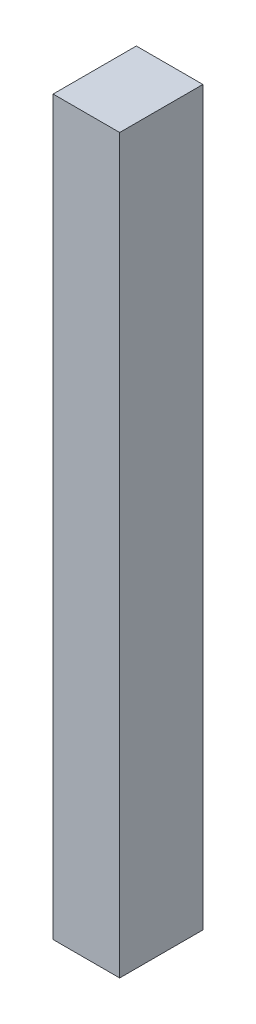
ISO-10303-21;
HEADER;
FILE_DESCRIPTION(('STEP AP214'),'2;1');
FILE_NAME('part.step','',(''),(''),'','','');
FILE_SCHEMA(('AUTOMOTIVE_DESIGN { 1 0 10303 214 1 1 1 1 }'));
ENDSEC;
DATA;
#1=APPLICATION_CONTEXT('core data for automotive mechanical design processes');
#2=APPLICATION_PROTOCOL_DEFINITION('international standard','automotive_design',2000,#1);
#3=PRODUCT_CONTEXT('',#1,'mechanical');
#4=PRODUCT('Part','Part','',(#3));
#5=PRODUCT_RELATED_PRODUCT_CATEGORY('part','',(#4));
#6=PRODUCT_DEFINITION_FORMATION('','',#4);
#7=PRODUCT_DEFINITION_CONTEXT('part definition',#1,'design');
#8=PRODUCT_DEFINITION('design','',#6,#7);
#9=PRODUCT_DEFINITION_SHAPE('','',#8);
#10=(LENGTH_UNIT() NAMED_UNIT(*) SI_UNIT(.MILLI.,.METRE.));
#11=(NAMED_UNIT(*) PLANE_ANGLE_UNIT() SI_UNIT($,.RADIAN.));
#12=(NAMED_UNIT(*) SI_UNIT($,.STERADIAN.) SOLID_ANGLE_UNIT());
#13=UNCERTAINTY_MEASURE_WITH_UNIT(LENGTH_MEASURE(1.E-05),#10,'distance_accuracy_value','');
#14=(GEOMETRIC_REPRESENTATION_CONTEXT(3) GLOBAL_UNCERTAINTY_ASSIGNED_CONTEXT((#13)) GLOBAL_UNIT_ASSIGNED_CONTEXT((#10,
#11,#12)) REPRESENTATION_CONTEXT('',''));
#15=CARTESIAN_POINT('',(0.,0.,0.));
#16=DIRECTION('',(0.,0.,1.));
#17=DIRECTION('',(1.,0.,0.));
#18=AXIS2_PLACEMENT_3D('',#15,#16,#17);
#19=CARTESIAN_POINT('',(39.9999999999998,440.,100.));
#20=DIRECTION('',(-1.,0.,0.));
#21=DIRECTION('',(0.,0.,1.));
#22=AXIS2_PLACEMENT_3D('',#19,#20,#21);
#23=PLANE('',#22);
#24=DIRECTION('',(0.,1.,0.));
#25=VECTOR('',#24,1.);
#26=CARTESIAN_POINT('',(39.9999999999998,440.,0.));
#27=LINE('',#26,#25);
#28=CARTESIAN_POINT('',(39.9999999999998,-440.,0.));
#29=VERTEX_POINT('',#28);
#30=CARTESIAN_POINT('',(39.9999999999998,440.,0.));
#31=VERTEX_POINT('',#30);
#32=EDGE_CURVE('E96',#29,#31,#27,.T.);
#33=ORIENTED_EDGE('',*,*,#32,.T.);
#34=DIRECTION('',(0.,0.,-1.));
#35=VECTOR('',#34,1.);
#36=CARTESIAN_POINT('',(39.9999999999998,440.,100.));
#37=LINE('',#36,#35);
#38=CARTESIAN_POINT('',(39.9999999999998,440.,100.));
#39=VERTEX_POINT('',#38);
#40=EDGE_CURVE('E11',#39,#31,#37,.T.);
#41=ORIENTED_EDGE('',*,*,#40,.F.);
#42=DIRECTION('',(0.,1.,0.));
#43=VECTOR('',#42,1.);
#44=CARTESIAN_POINT('',(39.9999999999998,440.,100.));
#45=LINE('',#44,#43);
#46=CARTESIAN_POINT('',(39.9999999999998,-440.,100.));
#47=VERTEX_POINT('',#46);
#48=EDGE_CURVE('E84',#47,#39,#45,.T.);
#49=ORIENTED_EDGE('',*,*,#48,.F.);
#50=DIRECTION('',(0.,0.,-1.));
#51=VECTOR('',#50,1.);
#52=CARTESIAN_POINT('',(39.9999999999998,-440.,100.));
#53=LINE('',#52,#51);
#54=EDGE_CURVE('E92',#47,#29,#53,.T.);
#55=ORIENTED_EDGE('',*,*,#54,.T.);
#56=EDGE_LOOP('',(#33,#41,#49,#55));
#57=FACE_BOUND('',#56,.T.);
#58=ADVANCED_FACE('F33',(#57),#23,.F.);
#59=CARTESIAN_POINT('',(-40.0000000000003,440.,100.));
#60=DIRECTION('',(0.,-1.,0.));
#61=DIRECTION('',(0.,0.,-1.));
#62=AXIS2_PLACEMENT_3D('',#59,#60,#61);
#63=PLANE('',#62);
#64=DIRECTION('',(-1.,0.,0.));
#65=VECTOR('',#64,1.);
#66=CARTESIAN_POINT('',(-40.0000000000003,440.,0.));
#67=LINE('',#66,#65);
#68=CARTESIAN_POINT('',(-40.0000000000003,440.,0.));
#69=VERTEX_POINT('',#68);
#70=EDGE_CURVE('E88',#31,#69,#67,.T.);
#71=ORIENTED_EDGE('',*,*,#70,.T.);
#72=DIRECTION('',(0.,0.,-1.));
#73=VECTOR('',#72,1.);
#74=CARTESIAN_POINT('',(-40.0000000000003,440.,100.));
#75=LINE('',#74,#73);
#76=CARTESIAN_POINT('',(-40.0000000000003,440.,100.));
#77=VERTEX_POINT('',#76);
#78=EDGE_CURVE('E41',#77,#69,#75,.T.);
#79=ORIENTED_EDGE('',*,*,#78,.F.);
#80=DIRECTION('',(-1.,0.,0.));
#81=VECTOR('',#80,1.);
#82=CARTESIAN_POINT('',(-40.0000000000003,440.,100.));
#83=LINE('',#82,#81);
#84=EDGE_CURVE('E79',#39,#77,#83,.T.);
#85=ORIENTED_EDGE('',*,*,#84,.F.);
#86=ORIENTED_EDGE('',*,*,#40,.T.);
#87=EDGE_LOOP('',(#71,#79,#85,#86));
#88=FACE_BOUND('',#87,.T.);
#89=ADVANCED_FACE('F87',(#88),#63,.F.);
#90=CARTESIAN_POINT('',(-40.0000000000003,440.,100.));
#91=DIRECTION('',(1.,0.,0.));
#92=DIRECTION('',(0.,0.,-1.));
#93=AXIS2_PLACEMENT_3D('',#90,#91,#92);
#94=PLANE('',#93);
#95=DIRECTION('',(0.,-1.,0.));
#96=VECTOR('',#95,1.);
#97=CARTESIAN_POINT('',(-40.0000000000003,440.,0.));
#98=LINE('',#97,#96);
#99=CARTESIAN_POINT('',(-40.0000000000003,-440.,0.));
#100=VERTEX_POINT('',#99);
#101=EDGE_CURVE('E66',#69,#100,#98,.T.);
#102=ORIENTED_EDGE('',*,*,#101,.T.);
#103=DIRECTION('',(0.,0.,-1.));
#104=VECTOR('',#103,1.);
#105=CARTESIAN_POINT('',(-40.0000000000003,-440.,100.));
#106=LINE('',#105,#104);
#107=CARTESIAN_POINT('',(-40.0000000000003,-440.,100.));
#108=VERTEX_POINT('',#107);
#109=EDGE_CURVE('E89',#108,#100,#106,.T.);
#110=ORIENTED_EDGE('',*,*,#109,.F.);
#111=DIRECTION('',(0.,-1.,0.));
#112=VECTOR('',#111,1.);
#113=CARTESIAN_POINT('',(-40.0000000000003,440.,100.));
#114=LINE('',#113,#112);
#115=EDGE_CURVE('E82',#77,#108,#114,.T.);
#116=ORIENTED_EDGE('',*,*,#115,.F.);
#117=ORIENTED_EDGE('',*,*,#78,.T.);
#118=EDGE_LOOP('',(#102,#110,#116,#117));
#119=FACE_BOUND('',#118,.T.);
#120=ADVANCED_FACE('F90',(#119),#94,.F.);
#121=CARTESIAN_POINT('',(-40.0000000000003,-440.,100.));
#122=DIRECTION('',(0.,1.,0.));
#123=DIRECTION('',(0.,0.,1.));
#124=AXIS2_PLACEMENT_3D('',#121,#122,#123);
#125=PLANE('',#124);
#126=DIRECTION('',(1.,0.,0.));
#127=VECTOR('',#126,1.);
#128=CARTESIAN_POINT('',(-40.0000000000003,-440.,0.));
#129=LINE('',#128,#127);
#130=EDGE_CURVE('E72',#100,#29,#129,.T.);
#131=ORIENTED_EDGE('',*,*,#130,.T.);
#132=ORIENTED_EDGE('',*,*,#54,.F.);
#133=DIRECTION('',(1.,0.,0.));
#134=VECTOR('',#133,1.);
#135=CARTESIAN_POINT('',(-40.0000000000003,-440.,100.));
#136=LINE('',#135,#134);
#137=EDGE_CURVE('E49',#108,#47,#136,.T.);
#138=ORIENTED_EDGE('',*,*,#137,.F.);
#139=ORIENTED_EDGE('',*,*,#109,.T.);
#140=EDGE_LOOP('',(#131,#132,#138,#139));
#141=FACE_BOUND('',#140,.T.);
#142=ADVANCED_FACE('F103',(#141),#125,.F.);
#143=CARTESIAN_POINT('',(0.,0.,100.));
#144=DIRECTION('',(0.,0.,1.));
#145=DIRECTION('',(1.,0.,0.));
#146=AXIS2_PLACEMENT_3D('',#143,#144,#145);
#147=PLANE('',#146);
#148=ORIENTED_EDGE('',*,*,#48,.T.);
#149=ORIENTED_EDGE('',*,*,#84,.T.);
#150=ORIENTED_EDGE('',*,*,#115,.T.);
#151=ORIENTED_EDGE('',*,*,#137,.T.);
#152=EDGE_LOOP('',(#148,#149,#150,#151));
#153=FACE_BOUND('',#152,.T.);
#154=ADVANCED_FACE('F80',(#153),#147,.T.);
#155=CARTESIAN_POINT('',(0.,0.,0.));
#156=DIRECTION('',(0.,0.,1.));
#157=DIRECTION('',(1.,0.,0.));
#158=AXIS2_PLACEMENT_3D('',#155,#156,#157);
#159=PLANE('',#158);
#160=ORIENTED_EDGE('',*,*,#32,.F.);
#161=ORIENTED_EDGE('',*,*,#130,.F.);
#162=ORIENTED_EDGE('',*,*,#101,.F.);
#163=ORIENTED_EDGE('',*,*,#70,.F.);
#164=EDGE_LOOP('',(#160,#161,#162,#163));
#165=FACE_BOUND('',#164,.T.);
#166=ADVANCED_FACE('F106',(#165),#159,.F.);
#167=CLOSED_SHELL('',(#58,#89,#120,#142,#154,#166));
#168=MANIFOLD_SOLID_BREP('B2',#167);
#169=ADVANCED_BREP_SHAPE_REPRESENTATION('',(#18,#168),#14);
#170=SHAPE_DEFINITION_REPRESENTATION(#9,#169);
ENDSEC;
END-ISO-10303-21;
